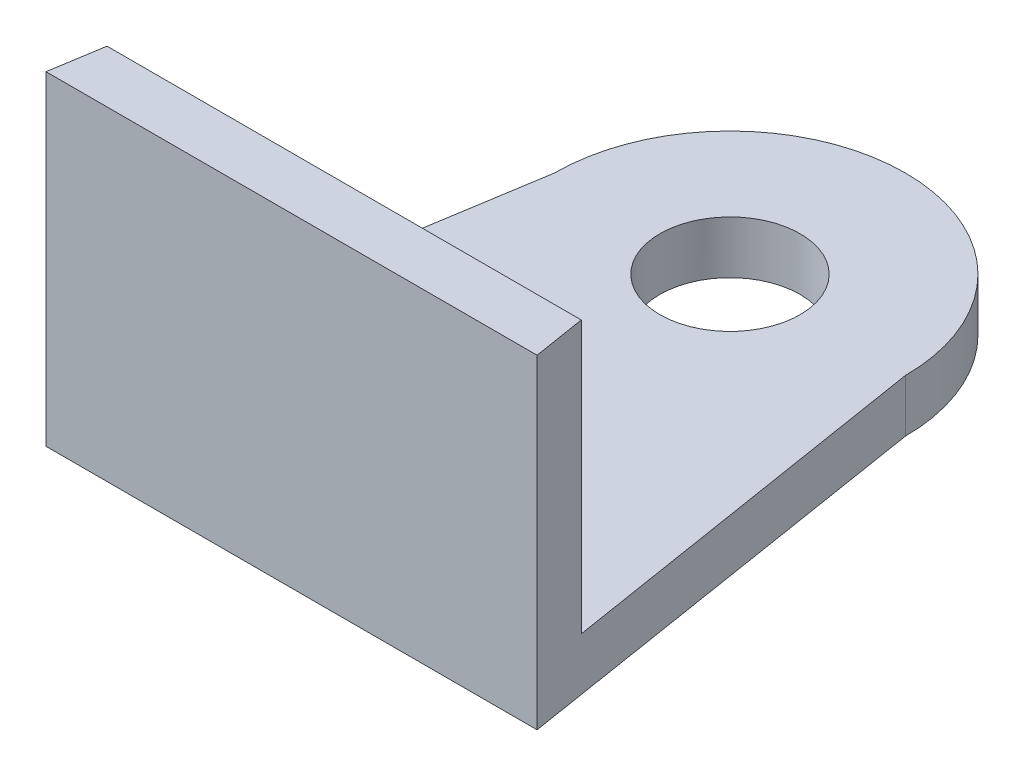
ISO-10303-21;
HEADER;
FILE_DESCRIPTION(('STEP AP214'),'2;1');
FILE_NAME('part.step','',(''),(''),'','','');
FILE_SCHEMA(('AUTOMOTIVE_DESIGN { 1 0 10303 214 1 1 1 1 }'));
ENDSEC;
DATA;
#1=APPLICATION_CONTEXT('core data for automotive mechanical design processes');
#2=APPLICATION_PROTOCOL_DEFINITION('international standard','automotive_design',2000,#1);
#3=PRODUCT_CONTEXT('',#1,'mechanical');
#4=PRODUCT('Part','Part','',(#3));
#5=PRODUCT_RELATED_PRODUCT_CATEGORY('part','',(#4));
#6=PRODUCT_DEFINITION_FORMATION('','',#4);
#7=PRODUCT_DEFINITION_CONTEXT('part definition',#1,'design');
#8=PRODUCT_DEFINITION('design','',#6,#7);
#9=PRODUCT_DEFINITION_SHAPE('','',#8);
#10=(LENGTH_UNIT() NAMED_UNIT(*) SI_UNIT(.MILLI.,.METRE.));
#11=(NAMED_UNIT(*) PLANE_ANGLE_UNIT() SI_UNIT($,.RADIAN.));
#12=(NAMED_UNIT(*) SI_UNIT($,.STERADIAN.) SOLID_ANGLE_UNIT());
#13=UNCERTAINTY_MEASURE_WITH_UNIT(LENGTH_MEASURE(1.E-05),#10,'distance_accuracy_value','');
#14=(GEOMETRIC_REPRESENTATION_CONTEXT(3) GLOBAL_UNCERTAINTY_ASSIGNED_CONTEXT((#13)) GLOBAL_UNIT_ASSIGNED_CONTEXT((#10,
#11,#12)) REPRESENTATION_CONTEXT('',''));
#15=CARTESIAN_POINT('',(0.,0.,0.));
#16=DIRECTION('',(0.,0.,1.));
#17=DIRECTION('',(1.,0.,0.));
#18=AXIS2_PLACEMENT_3D('',#15,#16,#17);
#19=CARTESIAN_POINT('',(0.,3.,0.));
#20=DIRECTION('',(0.,-1.,0.));
#21=DIRECTION('',(0.,0.,-1.));
#22=AXIS2_PLACEMENT_3D('',#19,#20,#21);
#23=PLANE('',#22);
#24=CARTESIAN_POINT('',(0.,3.,0.));
#25=DIRECTION('',(0.,1.,0.));
#26=DIRECTION('',(0.,0.,1.));
#27=AXIS2_PLACEMENT_3D('',#24,#25,#26);
#28=CIRCLE('',#27,4.);
#29=CARTESIAN_POINT('',(0.,3.,4.));
#30=VERTEX_POINT('',#29);
#31=EDGE_CURVE('E102',#30,#30,#28,.T.);
#32=ORIENTED_EDGE('',*,*,#31,.F.);
#33=EDGE_LOOP('',(#32));
#34=FACE_BOUND('',#33,.T.);
#35=DIRECTION('',(-1.,0.,0.));
#36=VECTOR('',#35,1.);
#37=CARTESIAN_POINT('',(-13.52,3.,22.));
#38=LINE('',#37,#36);
#39=CARTESIAN_POINT('',(13.52,3.,22.));
#40=VERTEX_POINT('',#39);
#41=CARTESIAN_POINT('',(-13.52,3.,22.));
#42=VERTEX_POINT('',#41);
#43=EDGE_CURVE('E52',#40,#42,#38,.T.);
#44=ORIENTED_EDGE('',*,*,#43,.F.);
#45=DIRECTION('',(-0.157990501106673,0.,-0.987440631916705));
#46=VECTOR('',#45,1.);
#47=CARTESIAN_POINT('',(10.,3.,0.));
#48=LINE('',#47,#46);
#49=CARTESIAN_POINT('',(10.,3.,0.));
#50=VERTEX_POINT('',#49);
#51=EDGE_CURVE('E57',#40,#50,#48,.T.);
#52=ORIENTED_EDGE('',*,*,#51,.T.);
#53=CARTESIAN_POINT('',(0.,3.,0.));
#54=DIRECTION('',(0.,1.,0.));
#55=DIRECTION('',(0.,0.,-1.));
#56=AXIS2_PLACEMENT_3D('',#53,#54,#55);
#57=CIRCLE('',#56,10.);
#58=CARTESIAN_POINT('',(-10.,3.,0.));
#59=VERTEX_POINT('',#58);
#60=EDGE_CURVE('E88',#50,#59,#57,.T.);
#61=ORIENTED_EDGE('',*,*,#60,.T.);
#62=DIRECTION('',(-0.157990501106673,0.,0.987440631916705));
#63=VECTOR('',#62,1.);
#64=CARTESIAN_POINT('',(-10.,3.,0.));
#65=LINE('',#64,#63);
#66=EDGE_CURVE('E112',#59,#42,#65,.T.);
#67=ORIENTED_EDGE('',*,*,#66,.T.);
#68=EDGE_LOOP('',(#44,#52,#61,#67));
#69=FACE_BOUND('',#68,.T.);
#70=ADVANCED_FACE('F35',(#34,#69),#23,.F.);
#71=CARTESIAN_POINT('',(0.,3.,0.));
#72=DIRECTION('',(0.,-1.,0.));
#73=DIRECTION('',(0.,0.,-1.));
#74=AXIS2_PLACEMENT_3D('',#71,#72,#73);
#75=CYLINDRICAL_SURFACE('',#74,10.);
#76=CARTESIAN_POINT('',(0.,0.,0.));
#77=DIRECTION('',(0.,1.,0.));
#78=DIRECTION('',(0.,0.,-1.));
#79=AXIS2_PLACEMENT_3D('',#76,#77,#78);
#80=CIRCLE('',#79,10.);
#81=CARTESIAN_POINT('',(10.,0.,0.));
#82=VERTEX_POINT('',#81);
#83=CARTESIAN_POINT('',(-10.,0.,0.));
#84=VERTEX_POINT('',#83);
#85=EDGE_CURVE('E94',#82,#84,#80,.T.);
#86=ORIENTED_EDGE('',*,*,#85,.T.);
#87=DIRECTION('',(0.,-1.,0.));
#88=VECTOR('',#87,1.);
#89=CARTESIAN_POINT('',(-10.,3.,0.));
#90=LINE('',#89,#88);
#91=EDGE_CURVE('E11',#59,#84,#90,.T.);
#92=ORIENTED_EDGE('',*,*,#91,.F.);
#93=ORIENTED_EDGE('',*,*,#60,.F.);
#94=DIRECTION('',(0.,-1.,0.));
#95=VECTOR('',#94,1.);
#96=CARTESIAN_POINT('',(10.,3.,0.));
#97=LINE('',#96,#95);
#98=EDGE_CURVE('E80',#50,#82,#97,.T.);
#99=ORIENTED_EDGE('',*,*,#98,.T.);
#100=EDGE_LOOP('',(#86,#92,#93,#99));
#101=FACE_BOUND('',#100,.T.);
#102=ADVANCED_FACE('F37',(#101),#75,.T.);
#103=CARTESIAN_POINT('',(-10.,3.,0.));
#104=DIRECTION('',(0.987440631916705,0.,0.157990501106673));
#105=DIRECTION('',(0.157990501106673,0.,-0.987440631916705));
#106=AXIS2_PLACEMENT_3D('',#103,#104,#105);
#107=PLANE('',#106);
#108=DIRECTION('',(-0.157990501106673,0.,0.987440631916705));
#109=VECTOR('',#108,1.);
#110=CARTESIAN_POINT('',(-10.,0.,0.));
#111=LINE('',#110,#109);
#112=CARTESIAN_POINT('',(-14.,0.,25.));
#113=VERTEX_POINT('',#112);
#114=EDGE_CURVE('E97',#84,#113,#111,.T.);
#115=ORIENTED_EDGE('',*,*,#114,.T.);
#116=DIRECTION('',(0.,-1.,0.));
#117=VECTOR('',#116,1.);
#118=CARTESIAN_POINT('',(-14.,3.,25.));
#119=LINE('',#118,#117);
#120=CARTESIAN_POINT('',(-14.,18.5,25.));
#121=VERTEX_POINT('',#120);
#122=EDGE_CURVE('E44',#121,#113,#119,.T.);
#123=ORIENTED_EDGE('',*,*,#122,.F.);
#124=DIRECTION('',(-0.157990501106673,0.,0.987440631916705));
#125=VECTOR('',#124,1.);
#126=CARTESIAN_POINT('',(-13.52,18.5,22.));
#127=LINE('',#126,#125);
#128=CARTESIAN_POINT('',(-13.52,18.5,22.));
#129=VERTEX_POINT('',#128);
#130=EDGE_CURVE('E126',#129,#121,#127,.T.);
#131=ORIENTED_EDGE('',*,*,#130,.F.);
#132=DIRECTION('',(0.,-1.,0.));
#133=VECTOR('',#132,1.);
#134=CARTESIAN_POINT('',(-13.52,18.5,22.));
#135=LINE('',#134,#133);
#136=EDGE_CURVE('E127',#129,#42,#135,.T.);
#137=ORIENTED_EDGE('',*,*,#136,.T.);
#138=ORIENTED_EDGE('',*,*,#66,.F.);
#139=ORIENTED_EDGE('',*,*,#91,.T.);
#140=EDGE_LOOP('',(#115,#123,#131,#137,#138,#139));
#141=FACE_BOUND('',#140,.T.);
#142=ADVANCED_FACE('F154',(#141),#107,.F.);
#143=CARTESIAN_POINT('',(-14.,3.,25.));
#144=DIRECTION('',(0.,0.,-1.));
#145=DIRECTION('',(-1.,0.,0.));
#146=AXIS2_PLACEMENT_3D('',#143,#144,#145);
#147=PLANE('',#146);
#148=DIRECTION('',(1.,0.,0.));
#149=VECTOR('',#148,1.);
#150=CARTESIAN_POINT('',(-14.,0.,25.));
#151=LINE('',#150,#149);
#152=CARTESIAN_POINT('',(14.,0.,25.));
#153=VERTEX_POINT('',#152);
#154=EDGE_CURVE('E89',#113,#153,#151,.T.);
#155=ORIENTED_EDGE('',*,*,#154,.T.);
#156=DIRECTION('',(0.,-1.,0.));
#157=VECTOR('',#156,1.);
#158=CARTESIAN_POINT('',(14.,3.,25.));
#159=LINE('',#158,#157);
#160=CARTESIAN_POINT('',(14.,18.5,25.));
#161=VERTEX_POINT('',#160);
#162=EDGE_CURVE('E84',#161,#153,#159,.T.);
#163=ORIENTED_EDGE('',*,*,#162,.F.);
#164=DIRECTION('',(1.,0.,0.));
#165=VECTOR('',#164,1.);
#166=CARTESIAN_POINT('',(-14.,18.5,25.));
#167=LINE('',#166,#165);
#168=EDGE_CURVE('E157',#121,#161,#167,.T.);
#169=ORIENTED_EDGE('',*,*,#168,.F.);
#170=ORIENTED_EDGE('',*,*,#122,.T.);
#171=EDGE_LOOP('',(#155,#163,#169,#170));
#172=FACE_BOUND('',#171,.T.);
#173=ADVANCED_FACE('F158',(#172),#147,.F.);
#174=CARTESIAN_POINT('',(10.,3.,0.));
#175=DIRECTION('',(-0.987440631916705,0.,0.157990501106673));
#176=DIRECTION('',(0.157990501106673,0.,0.987440631916705));
#177=AXIS2_PLACEMENT_3D('',#174,#175,#176);
#178=PLANE('',#177);
#179=DIRECTION('',(-0.157990501106673,0.,-0.987440631916705));
#180=VECTOR('',#179,1.);
#181=CARTESIAN_POINT('',(10.,0.,0.));
#182=LINE('',#181,#180);
#183=EDGE_CURVE('E77',#153,#82,#182,.T.);
#184=ORIENTED_EDGE('',*,*,#183,.T.);
#185=ORIENTED_EDGE('',*,*,#98,.F.);
#186=ORIENTED_EDGE('',*,*,#51,.F.);
#187=DIRECTION('',(0.,-1.,0.));
#188=VECTOR('',#187,1.);
#189=CARTESIAN_POINT('',(13.52,18.5,22.));
#190=LINE('',#189,#188);
#191=CARTESIAN_POINT('',(13.52,18.5,22.));
#192=VERTEX_POINT('',#191);
#193=EDGE_CURVE('E120',#192,#40,#190,.T.);
#194=ORIENTED_EDGE('',*,*,#193,.F.);
#195=DIRECTION('',(-0.157990501106673,0.,-0.987440631916705));
#196=VECTOR('',#195,1.);
#197=CARTESIAN_POINT('',(14.,18.5,25.));
#198=LINE('',#197,#196);
#199=EDGE_CURVE('E142',#161,#192,#198,.T.);
#200=ORIENTED_EDGE('',*,*,#199,.F.);
#201=ORIENTED_EDGE('',*,*,#162,.T.);
#202=EDGE_LOOP('',(#184,#185,#186,#194,#200,#201));
#203=FACE_BOUND('',#202,.T.);
#204=ADVANCED_FACE('F79',(#203),#178,.F.);
#205=CARTESIAN_POINT('',(0.,0.,0.));
#206=DIRECTION('',(0.,-1.,0.));
#207=DIRECTION('',(0.,0.,-1.));
#208=AXIS2_PLACEMENT_3D('',#205,#206,#207);
#209=PLANE('',#208);
#210=CARTESIAN_POINT('',(0.,0.,0.));
#211=DIRECTION('',(0.,-1.,0.));
#212=DIRECTION('',(0.,0.,-1.));
#213=AXIS2_PLACEMENT_3D('',#210,#211,#212);
#214=CIRCLE('',#213,4.);
#215=CARTESIAN_POINT('',(0.,0.,-4.));
#216=VERTEX_POINT('',#215);
#217=EDGE_CURVE('E98',#216,#216,#214,.T.);
#218=ORIENTED_EDGE('',*,*,#217,.F.);
#219=EDGE_LOOP('',(#218));
#220=FACE_BOUND('',#219,.T.);
#221=ORIENTED_EDGE('',*,*,#85,.F.);
#222=ORIENTED_EDGE('',*,*,#183,.F.);
#223=ORIENTED_EDGE('',*,*,#154,.F.);
#224=ORIENTED_EDGE('',*,*,#114,.F.);
#225=EDGE_LOOP('',(#221,#222,#223,#224));
#226=FACE_BOUND('',#225,.T.);
#227=ADVANCED_FACE('F96',(#220,#226),#209,.T.);
#228=CARTESIAN_POINT('',(0.,-10.,0.));
#229=DIRECTION('',(0.,1.,0.));
#230=DIRECTION('',(0.,0.,1.));
#231=AXIS2_PLACEMENT_3D('',#228,#229,#230);
#232=CYLINDRICAL_SURFACE('',#231,4.);
#233=ORIENTED_EDGE('',*,*,#217,.T.);
#234=EDGE_LOOP('',(#233));
#235=FACE_BOUND('',#234,.T.);
#236=ORIENTED_EDGE('',*,*,#31,.T.);
#237=EDGE_LOOP('',(#236));
#238=FACE_BOUND('',#237,.T.);
#239=ADVANCED_FACE('F171',(#235,#238),#232,.F.);
#240=CARTESIAN_POINT('',(-13.52,18.5,22.));
#241=DIRECTION('',(0.,0.,1.));
#242=DIRECTION('',(1.,0.,0.));
#243=AXIS2_PLACEMENT_3D('',#240,#241,#242);
#244=PLANE('',#243);
#245=ORIENTED_EDGE('',*,*,#43,.T.);
#246=ORIENTED_EDGE('',*,*,#136,.F.);
#247=DIRECTION('',(-1.,0.,0.));
#248=VECTOR('',#247,1.);
#249=CARTESIAN_POINT('',(-13.52,18.5,22.));
#250=LINE('',#249,#248);
#251=EDGE_CURVE('E123',#192,#129,#250,.T.);
#252=ORIENTED_EDGE('',*,*,#251,.F.);
#253=ORIENTED_EDGE('',*,*,#193,.T.);
#254=EDGE_LOOP('',(#245,#246,#252,#253));
#255=FACE_BOUND('',#254,.T.);
#256=ADVANCED_FACE('F135',(#255),#244,.F.);
#257=CARTESIAN_POINT('',(0.,18.5,0.));
#258=DIRECTION('',(0.,1.,0.));
#259=DIRECTION('',(0.,0.,1.));
#260=AXIS2_PLACEMENT_3D('',#257,#258,#259);
#261=PLANE('',#260);
#262=ORIENTED_EDGE('',*,*,#130,.T.);
#263=ORIENTED_EDGE('',*,*,#168,.T.);
#264=ORIENTED_EDGE('',*,*,#199,.T.);
#265=ORIENTED_EDGE('',*,*,#251,.T.);
#266=EDGE_LOOP('',(#262,#263,#264,#265));
#267=FACE_BOUND('',#266,.T.);
#268=ADVANCED_FACE('F160',(#267),#261,.T.);
#269=CLOSED_SHELL('',(#70,#102,#142,#173,#204,#227,#239,#256,#268));
#270=MANIFOLD_SOLID_BREP('B2',#269);
#271=ADVANCED_BREP_SHAPE_REPRESENTATION('',(#18,#270),#14);
#272=SHAPE_DEFINITION_REPRESENTATION(#9,#271);
ENDSEC;
END-ISO-10303-21;
